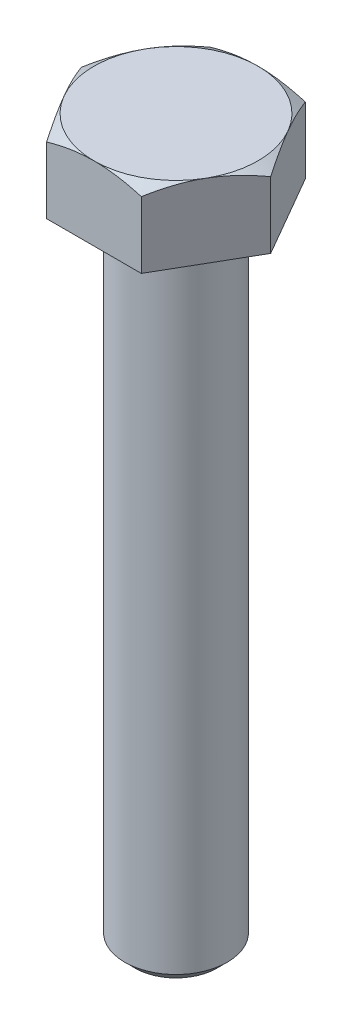
ISO-10303-21;
HEADER;
FILE_DESCRIPTION(('STEP AP214'),'2;1');
FILE_NAME('part.step','',(''),(''),'','','');
FILE_SCHEMA(('AUTOMOTIVE_DESIGN { 1 0 10303 214 1 1 1 1 }'));
ENDSEC;
DATA;
#1=APPLICATION_CONTEXT('core data for automotive mechanical design processes');
#2=APPLICATION_PROTOCOL_DEFINITION('international standard','automotive_design',2000,#1);
#3=PRODUCT_CONTEXT('',#1,'mechanical');
#4=PRODUCT('Part','Part','',(#3));
#5=PRODUCT_RELATED_PRODUCT_CATEGORY('part','',(#4));
#6=PRODUCT_DEFINITION_FORMATION('','',#4);
#7=PRODUCT_DEFINITION_CONTEXT('part definition',#1,'design');
#8=PRODUCT_DEFINITION('design','',#6,#7);
#9=PRODUCT_DEFINITION_SHAPE('','',#8);
#10=(LENGTH_UNIT() NAMED_UNIT(*) SI_UNIT(.MILLI.,.METRE.));
#11=(NAMED_UNIT(*) PLANE_ANGLE_UNIT() SI_UNIT($,.RADIAN.));
#12=(NAMED_UNIT(*) SI_UNIT($,.STERADIAN.) SOLID_ANGLE_UNIT());
#13=UNCERTAINTY_MEASURE_WITH_UNIT(LENGTH_MEASURE(1.E-05),#10,'distance_accuracy_value','');
#14=(GEOMETRIC_REPRESENTATION_CONTEXT(3) GLOBAL_UNCERTAINTY_ASSIGNED_CONTEXT((#13)) GLOBAL_UNIT_ASSIGNED_CONTEXT((#10,
#11,#12)) REPRESENTATION_CONTEXT('',''));
#15=CARTESIAN_POINT('',(0.,0.,0.));
#16=DIRECTION('',(0.,0.,1.));
#17=DIRECTION('',(1.,0.,0.));
#18=AXIS2_PLACEMENT_3D('',#15,#16,#17);
#19=CARTESIAN_POINT('',(-4.61880215351701,3.6,0.));
#20=DIRECTION('',(0.866025403784438,0.,-0.5));
#21=DIRECTION('',(-0.5,0.,-0.866025403784438));
#22=AXIS2_PLACEMENT_3D('',#19,#20,#21);
#23=PLANE('',#22);
#24=DIRECTION('',(0.,-1.,0.));
#25=VECTOR('',#24,1.);
#26=CARTESIAN_POINT('',(-2.3094010767585,3.6,4.));
#27=LINE('',#26,#25);
#28=CARTESIAN_POINT('',(-2.3094010767585,3.24273441009184,4.));
#29=VERTEX_POINT('',#28);
#30=CARTESIAN_POINT('',(-2.3094010767585,0.,4.));
#31=VERTEX_POINT('',#30);
#32=EDGE_CURVE('E131',#29,#31,#27,.T.);
#33=ORIENTED_EDGE('',*,*,#32,.F.);
#34=CARTESIAN_POINT('',(-2.30928560670467,3.24266774092524,4.0002));
#35=CARTESIAN_POINT('',(-2.4107717464617,3.30128212635172,3.82442084967677));
#36=CARTESIAN_POINT('',(-2.51313390883499,3.35458967853774,3.64712438367362));
#37=CARTESIAN_POINT('',(-2.71963072479812,3.4476383292536,3.28946140682429));
#38=CARTESIAN_POINT('',(-2.82376904741904,3.4873465109703,3.10908854102985));
#39=CARTESIAN_POINT('',(-3.03075510011795,3.54915778471972,2.75057818129721));
#40=CARTESIAN_POINT('',(-3.13357098372492,3.57167226847711,2.57249584706486));
#41=CARTESIAN_POINT('',(-3.33968651028528,3.59854937685342,2.21549328283349));
#42=CARTESIAN_POINT('',(-3.44298540411434,3.60293425857306,2.0365743503559));
#43=CARTESIAN_POINT('',(-3.63600352522932,3.59380992706003,1.70225715780327));
#44=CARTESIAN_POINT('',(-3.72575165335065,3.58254104601201,1.54680884001294));
#45=CARTESIAN_POINT('',(-3.90466320392054,3.54682600920181,1.23692494436495));
#46=CARTESIAN_POINT('',(-3.99382600759478,3.52236765428847,1.08249043825587));
#47=CARTESIAN_POINT('',(-4.17310641015197,3.46122393508071,0.771967672225424));
#48=CARTESIAN_POINT('',(-4.26320131938131,3.42427939634514,0.6159187119369));
#49=CARTESIAN_POINT('',(-4.4420474282755,3.34042992745198,0.306148164596163));
#50=CARTESIAN_POINT('',(-4.53080091904966,3.29354469778726,0.152422609226223));
#51=CARTESIAN_POINT('',(-4.61891762357085,3.24266774092524,-0.000199999999998293));
#52=B_SPLINE_CURVE_WITH_KNOTS('',3,(#34,#35,#36,#37,#38,#39,#40,#41,#42,#43,#44,#45,#46,#47,#48,
#49,#50,#51),.UNSPECIFIED.,.F.,.F.,(4,2,2,2,2,2,2,2,4),(0.,0.634047835695965,1.26961969224543,
1.88946157213122,2.50854226669297,3.04757825393385,3.58711366126903,4.13861653143763,
4.68903648037743),.UNSPECIFIED.);
#53=CARTESIAN_POINT('',(-3.46410161513776,3.6,2.));
#54=VERTEX_POINT('',#53);
#55=EDGE_CURVE('E113',#29,#54,#52,.T.);
#56=ORIENTED_EDGE('',*,*,#55,.T.);
#57=CARTESIAN_POINT('',(-4.61880215351701,3.24273441009184,0.));
#58=VERTEX_POINT('',#57);
#59=EDGE_CURVE('E50',#54,#58,#52,.T.);
#60=ORIENTED_EDGE('',*,*,#59,.T.);
#61=DIRECTION('',(0.,-1.,0.));
#62=VECTOR('',#61,1.);
#63=CARTESIAN_POINT('',(-4.61880215351701,3.6,0.));
#64=LINE('',#63,#62);
#65=CARTESIAN_POINT('',(-4.61880215351701,0.,0.));
#66=VERTEX_POINT('',#65);
#67=EDGE_CURVE('E219',#58,#66,#64,.T.);
#68=ORIENTED_EDGE('',*,*,#67,.T.);
#69=DIRECTION('',(0.5,0.,0.866025403784438));
#70=VECTOR('',#69,1.);
#71=CARTESIAN_POINT('',(-4.61880215351701,0.,0.));
#72=LINE('',#71,#70);
#73=EDGE_CURVE('E251',#66,#31,#72,.T.);
#74=ORIENTED_EDGE('',*,*,#73,.T.);
#75=EDGE_LOOP('',(#33,#56,#60,#68,#74));
#76=FACE_BOUND('',#75,.T.);
#77=ADVANCED_FACE('F35',(#76),#23,.F.);
#78=CARTESIAN_POINT('',(-2.3094010767585,3.6,4.));
#79=DIRECTION('',(0.,0.,-1.));
#80=DIRECTION('',(-1.,0.,0.));
#81=AXIS2_PLACEMENT_3D('',#78,#79,#80);
#82=PLANE('',#81);
#83=DIRECTION('',(0.,-1.,0.));
#84=VECTOR('',#83,1.);
#85=CARTESIAN_POINT('',(2.3094010767585,3.6,4.));
#86=LINE('',#85,#84);
#87=CARTESIAN_POINT('',(2.3094010767585,3.24273441009184,4.));
#88=VERTEX_POINT('',#87);
#89=CARTESIAN_POINT('',(2.3094010767585,0.,4.));
#90=VERTEX_POINT('',#89);
#91=EDGE_CURVE('E140',#88,#90,#86,.T.);
#92=ORIENTED_EDGE('',*,*,#91,.F.);
#93=CARTESIAN_POINT('',(-6.24940635930047,1.62551344036776,4.));
#94=CARTESIAN_POINT('',(-6.07428448900049,1.71064747987545,4.));
#95=CARTESIAN_POINT('',(-5.89876548029326,1.79497835243417,4.));
#96=CARTESIAN_POINT('',(-5.54672211906498,1.96158287333262,4.));
#97=CARTESIAN_POINT('',(-5.37019761736144,2.04385620609498,4.));
#98=CARTESIAN_POINT('',(-5.01504490338349,2.20629872772743,4.));
#99=CARTESIAN_POINT('',(-4.83641049751753,2.28645442132201,4.));
#100=CARTESIAN_POINT('',(-4.47773664602175,2.44354583504124,4.));
#101=CARTESIAN_POINT('',(-4.29769726596282,2.52048170438302,4.));
#102=CARTESIAN_POINT('',(-3.92999059977646,2.67274299461611,4.));
#103=CARTESIAN_POINT('',(-3.74226684291809,2.74793277274817,4.));
#104=CARTESIAN_POINT('',(-3.36464028006104,2.89273242177569,4.));
#105=CARTESIAN_POINT('',(-3.17473723480372,2.96234167316809,4.));
#106=CARTESIAN_POINT('',(-2.79279054903283,3.09418697758614,4.));
#107=CARTESIAN_POINT('',(-2.60075197178906,3.15643755350068,4.));
#108=CARTESIAN_POINT('',(-2.21392056037313,3.27159868104598,4.));
#109=CARTESIAN_POINT('',(-2.01912859936243,3.32451212497295,4.));
#110=CARTESIAN_POINT('',(-1.62774482428684,3.41821266061792,4.));
#111=CARTESIAN_POINT('',(-1.43116908477214,3.45906567182457,4.));
#112=CARTESIAN_POINT('',(-1.03552574288184,3.52636004480861,4.));
#113=CARTESIAN_POINT('',(-0.836458400413585,3.55280289715001,4.));
#114=CARTESIAN_POINT('',(-0.439446091637487,3.58882332594793,4.));
#115=CARTESIAN_POINT('',(-0.24152163810569,3.59862141132696,4.));
#116=CARTESIAN_POINT('',(0.154453996402157,3.60110504909964,4.));
#117=CARTESIAN_POINT('',(0.352505179929297,3.59379024543415,4.));
#118=CARTESIAN_POINT('',(0.687338202310109,3.56747918456206,4.));
#119=CARTESIAN_POINT('',(0.82447278485569,3.55270191181686,4.));
#120=CARTESIAN_POINT('',(1.09776247444183,3.51583749827029,4.));
#121=CARTESIAN_POINT('',(1.23391745151307,3.49374940513334,4.));
#122=CARTESIAN_POINT('',(1.64071426863145,3.41767735393902,4.));
#123=CARTESIAN_POINT('',(1.909546136988,3.35389827442858,4.));
#124=CARTESIAN_POINT('',(2.31167487066307,3.24297219927682,4.));
#125=CARTESIAN_POINT('',(2.44704596337128,3.2029139467991,4.));
#126=CARTESIAN_POINT('',(2.71647338785264,3.11855757903275,4.));
#127=CARTESIAN_POINT('',(2.8505297099327,3.07425943251157,4.));
#128=CARTESIAN_POINT('',(3.11736990171724,2.98214085736617,4.));
#129=CARTESIAN_POINT('',(3.25015414507458,2.93432150127419,4.));
#130=CARTESIAN_POINT('',(3.51461580134907,2.83573112785319,4.));
#131=CARTESIAN_POINT('',(3.64629323601141,2.7849601686694,4.));
#132=CARTESIAN_POINT('',(3.98974115401558,2.64882040183493,4.));
#133=CARTESIAN_POINT('',(4.20072121370987,2.56145980267336,4.));
#134=CARTESIAN_POINT('',(4.6206111085548,2.3818810585617,4.));
#135=CARTESIAN_POINT('',(4.82952074345979,2.28966244910213,4.));
#136=CARTESIAN_POINT('',(5.24571734836435,2.10147917973074,4.));
#137=CARTESIAN_POINT('',(5.45300380399208,2.00551338579897,4.));
#138=CARTESIAN_POINT('',(5.86621623056716,1.81069039404226,4.));
#139=CARTESIAN_POINT('',(6.07214216333142,1.71183311548681,4.));
#140=CARTESIAN_POINT('',(6.48317576116128,1.5116988626759,4.));
#141=CARTESIAN_POINT('',(6.68828184186467,1.41041864083382,4.));
#142=CARTESIAN_POINT('',(7.09758118816534,1.20602838870632,4.));
#143=CARTESIAN_POINT('',(7.30177444450839,1.1029183399225,4.));
#144=CARTESIAN_POINT('',(7.91315088994458,0.79142667249073,4.));
#145=CARTESIAN_POINT('',(8.31921202095451,0.580843592735333,4.));
#146=CARTESIAN_POINT('',(9.08866531435688,0.177008308553519,4.));
#147=CARTESIAN_POINT('',(9.45225649813083,-0.015866483077707,4.));
#148=CARTESIAN_POINT('',(10.1781923686025,-0.403993091815227,4.));
#149=CARTESIAN_POINT('',(10.5405369871479,-0.59924503631772,4.));
#150=CARTESIAN_POINT('',(11.2631431051462,-0.990910831585374,4.));
#151=CARTESIAN_POINT('',(11.6234075799627,-1.18731920155307,4.));
#152=CARTESIAN_POINT('',(12.3431558971906,-1.58150085066985,4.));
#153=CARTESIAN_POINT('',(12.7026397935455,-1.77927403128081,4.));
#154=CARTESIAN_POINT('',(13.0618463100356,-1.97754655898725,4.));
#155=B_SPLINE_CURVE_WITH_KNOTS('',3,(#93,#94,#95,#96,#97,#98,#99,#100,#101,#102,#103,#104,#105,
#106,#107,#108,#109,#110,#111,#112,#113,#114,#115,#116,#117,#118,#119,#120,#121,#122,#123,#124,
#125,#126,#127,#128,#129,#130,#131,#132,#133,#134,#135,#136,#137,#138,#139,#140,#141,#142,#143,
#144,#145,#146,#147,#148,#149,#150,#151,#152,#153,#154),.UNSPECIFIED.,.F.,.F.,(4,2,2,2,2,2,2,2,
2,2,2,2,2,2,2,2,2,2,2,2,2,2,2,2,2,2,2,2,2,2,4),(0.,0.584163807823883,1.16841666962886,
1.75577240153706,2.34310088325995,2.94969809380426,3.5563625506822,4.16180898136352,
4.76706753677513,5.36895389225969,5.97077797774916,6.56456509717167,7.15836457132933,
7.57195031441829,7.98558995399365,8.81329454925417,9.23677834024344,9.66026525100243,
10.0836237003962,10.5069738126466,11.191939723508,11.8769712482122,12.5622117174091,
13.2474713368833,13.9337075353919,14.6199506752735,15.9921653348798,17.2269004214626,
18.4617019737336,19.6926743313507,20.9235587247819),.UNSPECIFIED.);
#156=CARTESIAN_POINT('',(0.,3.6,4.));
#157=VERTEX_POINT('',#156);
#158=EDGE_CURVE('E117',#88,#157,#155,.F.);
#159=ORIENTED_EDGE('',*,*,#158,.T.);
#160=EDGE_CURVE('E106',#157,#29,#155,.F.);
#161=ORIENTED_EDGE('',*,*,#160,.T.);
#162=ORIENTED_EDGE('',*,*,#32,.T.);
#163=DIRECTION('',(1.,0.,0.));
#164=VECTOR('',#163,1.);
#165=CARTESIAN_POINT('',(-2.3094010767585,0.,4.));
#166=LINE('',#165,#164);
#167=EDGE_CURVE('E255',#31,#90,#166,.T.);
#168=ORIENTED_EDGE('',*,*,#167,.T.);
#169=EDGE_LOOP('',(#92,#159,#161,#162,#168));
#170=FACE_BOUND('',#169,.T.);
#171=ADVANCED_FACE('F138',(#170),#82,.F.);
#172=CARTESIAN_POINT('',(2.3094010767585,3.6,4.));
#173=DIRECTION('',(-0.866025403784439,0.,-0.5));
#174=DIRECTION('',(-0.5,0.,0.866025403784439));
#175=AXIS2_PLACEMENT_3D('',#172,#173,#174);
#176=PLANE('',#175);
#177=DIRECTION('',(0.,-1.,0.));
#178=VECTOR('',#177,1.);
#179=CARTESIAN_POINT('',(4.618802153517,3.6,0.));
#180=LINE('',#179,#178);
#181=CARTESIAN_POINT('',(4.618802153517,3.24273441009184,0.));
#182=VERTEX_POINT('',#181);
#183=CARTESIAN_POINT('',(4.618802153517,0.,0.));
#184=VERTEX_POINT('',#183);
#185=EDGE_CURVE('E215',#182,#184,#180,.T.);
#186=ORIENTED_EDGE('',*,*,#185,.F.);
#187=CARTESIAN_POINT('',(4.61891762357084,3.24266774092524,-0.000200000000001151));
#188=CARTESIAN_POINT('',(4.5174314838138,3.30128212635172,0.175579150323226));
#189=CARTESIAN_POINT('',(4.41506932144052,3.35458967853774,0.352875616326379));
#190=CARTESIAN_POINT('',(4.20857250547739,3.4476383292536,0.710538593175704));
#191=CARTESIAN_POINT('',(4.10443418285647,3.4873465109703,0.890911458970149));
#192=CARTESIAN_POINT('',(3.89744813015756,3.54915778471972,1.24942181870279));
#193=CARTESIAN_POINT('',(3.79463224655059,3.57167226847711,1.42750415293514));
#194=CARTESIAN_POINT('',(3.58851671999023,3.59854937685342,1.78450671716651));
#195=CARTESIAN_POINT('',(3.48521782616117,3.60293425857306,1.9634256496441));
#196=CARTESIAN_POINT('',(3.29219970504619,3.59380992706003,2.29774284219673));
#197=CARTESIAN_POINT('',(3.20245157692486,3.58254104601201,2.45319115998706));
#198=CARTESIAN_POINT('',(3.02354002635497,3.54682600920181,2.76307505563505));
#199=CARTESIAN_POINT('',(2.93437722268073,3.52236765428847,2.91750956174413));
#200=CARTESIAN_POINT('',(2.75509682012354,3.46122393508071,3.22803232777458));
#201=CARTESIAN_POINT('',(2.6650019108942,3.42427939634514,3.3840812880631));
#202=CARTESIAN_POINT('',(2.48615580200001,3.34042992745198,3.69385183540384));
#203=CARTESIAN_POINT('',(2.39740231122585,3.29354469778726,3.84757739077378));
#204=CARTESIAN_POINT('',(2.30928560670466,3.24266774092524,4.0002));
#205=B_SPLINE_CURVE_WITH_KNOTS('',3,(#187,#188,#189,#190,#191,#192,#193,#194,#195,#196,#197,
#198,#199,#200,#201,#202,#203,#204),.UNSPECIFIED.,.F.,.F.,(4,2,2,2,2,2,2,2,4),(0.,
0.634047835695964,1.26961969224543,1.88946157213122,2.50854226669297,3.04757825393385,
3.58711366126903,4.13861653143764,4.68903648037743),.UNSPECIFIED.);
#206=CARTESIAN_POINT('',(3.46410161513776,3.6,2.));
#207=VERTEX_POINT('',#206);
#208=EDGE_CURVE('E256',#182,#207,#205,.T.);
#209=ORIENTED_EDGE('',*,*,#208,.T.);
#210=EDGE_CURVE('E126',#207,#88,#205,.T.);
#211=ORIENTED_EDGE('',*,*,#210,.T.);
#212=ORIENTED_EDGE('',*,*,#91,.T.);
#213=DIRECTION('',(0.5,0.,-0.866025403784439));
#214=VECTOR('',#213,1.);
#215=CARTESIAN_POINT('',(2.3094010767585,0.,4.));
#216=LINE('',#215,#214);
#217=EDGE_CURVE('E257',#90,#184,#216,.T.);
#218=ORIENTED_EDGE('',*,*,#217,.T.);
#219=EDGE_LOOP('',(#186,#209,#211,#212,#218));
#220=FACE_BOUND('',#219,.T.);
#221=ADVANCED_FACE('F167',(#220),#176,.F.);
#222=CARTESIAN_POINT('',(4.618802153517,3.6,0.));
#223=DIRECTION('',(-0.866025403784438,0.,0.5));
#224=DIRECTION('',(0.5,0.,0.866025403784439));
#225=AXIS2_PLACEMENT_3D('',#222,#223,#224);
#226=PLANE('',#225);
#227=DIRECTION('',(0.,-1.,0.));
#228=VECTOR('',#227,1.);
#229=CARTESIAN_POINT('',(2.3094010767585,3.6,-4.));
#230=LINE('',#229,#228);
#231=CARTESIAN_POINT('',(2.3094010767585,3.24273441009184,-4.));
#232=VERTEX_POINT('',#231);
#233=CARTESIAN_POINT('',(2.3094010767585,0.,-4.));
#234=VERTEX_POINT('',#233);
#235=EDGE_CURVE('E209',#232,#234,#230,.T.);
#236=ORIENTED_EDGE('',*,*,#235,.F.);
#237=CARTESIAN_POINT('',(2.30928560670466,3.24266774092524,-4.0002));
#238=CARTESIAN_POINT('',(2.4107717464617,3.30128212635172,-3.82442084967677));
#239=CARTESIAN_POINT('',(2.51313390883499,3.35458967853774,-3.64712438367362));
#240=CARTESIAN_POINT('',(2.71963072479811,3.4476383292536,-3.2894614068243));
#241=CARTESIAN_POINT('',(2.82376904741904,3.4873465109703,-3.10908854102985));
#242=CARTESIAN_POINT('',(3.03075510011795,3.54915778471972,-2.75057818129721));
#243=CARTESIAN_POINT('',(3.13357098372491,3.57167226847711,-2.57249584706486));
#244=CARTESIAN_POINT('',(3.33968651028528,3.59854937685342,-2.21549328283349));
#245=CARTESIAN_POINT('',(3.44298540411434,3.60293425857306,-2.0365743503559));
#246=CARTESIAN_POINT('',(3.63600352522932,3.59380992706003,-1.70225715780327));
#247=CARTESIAN_POINT('',(3.72575165335064,3.58254104601201,-1.54680884001294));
#248=CARTESIAN_POINT('',(3.90466320392054,3.54682600920181,-1.23692494436495));
#249=CARTESIAN_POINT('',(3.99382600759478,3.52236765428847,-1.08249043825587));
#250=CARTESIAN_POINT('',(4.17310641015197,3.46122393508072,-0.771967672225425));
#251=CARTESIAN_POINT('',(4.26320131938131,3.42427939634514,-0.6159187119369));
#252=CARTESIAN_POINT('',(4.4420474282755,3.34042992745198,-0.306148164596163));
#253=CARTESIAN_POINT('',(4.53080091904966,3.29354469778727,-0.152422609226223));
#254=CARTESIAN_POINT('',(4.61891762357084,3.24266774092524,0.000199999999998474));
#255=B_SPLINE_CURVE_WITH_KNOTS('',3,(#237,#238,#239,#240,#241,#242,#243,#244,#245,#246,#247,
#248,#249,#250,#251,#252,#253,#254),.UNSPECIFIED.,.F.,.F.,(4,2,2,2,2,2,2,2,4),(0.,
0.634047835695965,1.26961969224543,1.88946157213122,2.50854226669297,3.04757825393385,
3.58711366126903,4.13861653143764,4.68903648037743),.UNSPECIFIED.);
#256=CARTESIAN_POINT('',(3.46410161513776,3.6,-2.));
#257=VERTEX_POINT('',#256);
#258=EDGE_CURVE('E118',#232,#257,#255,.T.);
#259=ORIENTED_EDGE('',*,*,#258,.T.);
#260=EDGE_CURVE('E141',#257,#182,#255,.T.);
#261=ORIENTED_EDGE('',*,*,#260,.T.);
#262=ORIENTED_EDGE('',*,*,#185,.T.);
#263=DIRECTION('',(-0.5,0.,-0.866025403784438));
#264=VECTOR('',#263,1.);
#265=CARTESIAN_POINT('',(4.618802153517,0.,0.));
#266=LINE('',#265,#264);
#267=EDGE_CURVE('E211',#184,#234,#266,.T.);
#268=ORIENTED_EDGE('',*,*,#267,.T.);
#269=EDGE_LOOP('',(#236,#259,#261,#262,#268));
#270=FACE_BOUND('',#269,.T.);
#271=ADVANCED_FACE('F195',(#270),#226,.F.);
#272=CARTESIAN_POINT('',(2.3094010767585,3.6,-4.));
#273=DIRECTION('',(0.,0.,1.));
#274=DIRECTION('',(1.,0.,0.));
#275=AXIS2_PLACEMENT_3D('',#272,#273,#274);
#276=PLANE('',#275);
#277=DIRECTION('',(0.,-1.,0.));
#278=VECTOR('',#277,1.);
#279=CARTESIAN_POINT('',(-2.3094010767585,3.6,-4.));
#280=LINE('',#279,#278);
#281=CARTESIAN_POINT('',(-2.3094010767585,3.24273441009184,-4.));
#282=VERTEX_POINT('',#281);
#283=CARTESIAN_POINT('',(-2.3094010767585,0.,-4.));
#284=VERTEX_POINT('',#283);
#285=EDGE_CURVE('E216',#282,#284,#280,.T.);
#286=ORIENTED_EDGE('',*,*,#285,.F.);
#287=CARTESIAN_POINT('',(-6.24940635930047,1.62551344036776,-4.));
#288=CARTESIAN_POINT('',(-6.0742844890005,1.71064747987545,-4.));
#289=CARTESIAN_POINT('',(-5.89876548029326,1.79497835243417,-4.));
#290=CARTESIAN_POINT('',(-5.54672211906498,1.96158287333261,-4.));
#291=CARTESIAN_POINT('',(-5.37019761736144,2.04385620609497,-4.));
#292=CARTESIAN_POINT('',(-5.01504490338349,2.20629872772743,-4.));
#293=CARTESIAN_POINT('',(-4.83641049751753,2.28645442132201,-4.));
#294=CARTESIAN_POINT('',(-4.47773664602175,2.44354583504124,-4.));
#295=CARTESIAN_POINT('',(-4.29769726596282,2.52048170438302,-4.));
#296=CARTESIAN_POINT('',(-3.92999059977646,2.67274299461611,-4.));
#297=CARTESIAN_POINT('',(-3.74226684291809,2.74793277274817,-4.));
#298=CARTESIAN_POINT('',(-3.36464028006104,2.89273242177569,-4.));
#299=CARTESIAN_POINT('',(-3.17473723480372,2.96234167316809,-4.));
#300=CARTESIAN_POINT('',(-2.79279054903283,3.09418697758614,-4.));
#301=CARTESIAN_POINT('',(-2.60075197178906,3.15643755350068,-4.));
#302=CARTESIAN_POINT('',(-2.21392056037313,3.27159868104598,-4.));
#303=CARTESIAN_POINT('',(-2.01912859936242,3.32451212497295,-4.));
#304=CARTESIAN_POINT('',(-1.62774482428684,3.41821266061792,-4.));
#305=CARTESIAN_POINT('',(-1.43116908477214,3.45906567182457,-4.));
#306=CARTESIAN_POINT('',(-1.03552574288184,3.52636004480861,-4.));
#307=CARTESIAN_POINT('',(-0.836458400413584,3.55280289715001,-4.));
#308=CARTESIAN_POINT('',(-0.439446091637487,3.58882332594793,-4.));
#309=CARTESIAN_POINT('',(-0.24152163810569,3.59862141132696,-4.));
#310=CARTESIAN_POINT('',(0.154453996402157,3.60110504909964,-4.));
#311=CARTESIAN_POINT('',(0.352505179929298,3.59379024543415,-4.));
#312=CARTESIAN_POINT('',(0.687338202310109,3.56747918456206,-4.));
#313=CARTESIAN_POINT('',(0.82447278485569,3.55270191181686,-4.));
#314=CARTESIAN_POINT('',(1.09776247444183,3.51583749827029,-4.));
#315=CARTESIAN_POINT('',(1.23391745151307,3.49374940513334,-4.));
#316=CARTESIAN_POINT('',(1.64071426863145,3.41767735393902,-4.));
#317=CARTESIAN_POINT('',(1.909546136988,3.35389827442858,-4.));
#318=CARTESIAN_POINT('',(2.31167487066307,3.24297219927682,-4.));
#319=CARTESIAN_POINT('',(2.44704596337128,3.2029139467991,-4.));
#320=CARTESIAN_POINT('',(2.71647338785264,3.11855757903275,-4.));
#321=CARTESIAN_POINT('',(2.8505297099327,3.07425943251157,-4.));
#322=CARTESIAN_POINT('',(3.11736990171724,2.98214085736617,-4.));
#323=CARTESIAN_POINT('',(3.25015414507458,2.93432150127419,-4.));
#324=CARTESIAN_POINT('',(3.51461580134908,2.83573112785319,-4.));
#325=CARTESIAN_POINT('',(3.64629323601141,2.78496016866939,-4.));
#326=CARTESIAN_POINT('',(3.98974115401559,2.64882040183492,-4.));
#327=CARTESIAN_POINT('',(4.20072121370987,2.56145980267335,-4.));
#328=CARTESIAN_POINT('',(4.6206111085548,2.3818810585617,-4.));
#329=CARTESIAN_POINT('',(4.82952074345979,2.28966244910213,-4.));
#330=CARTESIAN_POINT('',(5.24571734836436,2.10147917973074,-4.));
#331=CARTESIAN_POINT('',(5.45300380399208,2.00551338579896,-4.));
#332=CARTESIAN_POINT('',(5.86621623056716,1.81069039404226,-4.));
#333=CARTESIAN_POINT('',(6.07214216333142,1.71183311548681,-4.));
#334=CARTESIAN_POINT('',(6.48317576116129,1.51169886267589,-4.));
#335=CARTESIAN_POINT('',(6.68828184186467,1.41041864083382,-4.));
#336=CARTESIAN_POINT('',(7.09758118816534,1.20602838870632,-4.));
#337=CARTESIAN_POINT('',(7.30177444450839,1.1029183399225,-4.));
#338=CARTESIAN_POINT('',(7.91315088994458,0.791426672490727,-4.));
#339=CARTESIAN_POINT('',(8.31921202095452,0.58084359273533,-4.));
#340=CARTESIAN_POINT('',(9.08866531435689,0.177008308553517,-4.));
#341=CARTESIAN_POINT('',(9.45225649813083,-0.0158664830777106,-4.));
#342=CARTESIAN_POINT('',(10.1781923686026,-0.40399309181523,-4.));
#343=CARTESIAN_POINT('',(10.5405369871479,-0.599245036317723,-4.));
#344=CARTESIAN_POINT('',(11.2631431051462,-0.990910831585375,-4.));
#345=CARTESIAN_POINT('',(11.6234075799627,-1.18731920155307,-4.));
#346=CARTESIAN_POINT('',(12.3431558971906,-1.58150085066985,-4.));
#347=CARTESIAN_POINT('',(12.7026397935455,-1.77927403128081,-4.));
#348=CARTESIAN_POINT('',(13.0618463100356,-1.97754655898725,-4.));
#349=B_SPLINE_CURVE_WITH_KNOTS('',3,(#287,#288,#289,#290,#291,#292,#293,#294,#295,#296,#297,
#298,#299,#300,#301,#302,#303,#304,#305,#306,#307,#308,#309,#310,#311,#312,#313,#314,#315,#316,
#317,#318,#319,#320,#321,#322,#323,#324,#325,#326,#327,#328,#329,#330,#331,#332,#333,#334,#335,
#336,#337,#338,#339,#340,#341,#342,#343,#344,#345,#346,#347,#348),.UNSPECIFIED.,.F.,.F.,(4,2,2,
2,2,2,2,2,2,2,2,2,2,2,2,2,2,2,2,2,2,2,2,2,2,2,2,2,2,2,4),(0.,0.584163807823882,1.16841666962886,
1.75577240153706,2.34310088325995,2.94969809380426,3.5563625506822,4.16180898136352,
4.76706753677513,5.36895389225969,5.97077797774916,6.56456509717168,7.15836457132933,
7.57195031441829,7.98558995399365,8.81329454925417,9.23677834024344,9.66026525100243,
10.0836237003962,10.5069738126466,11.191939723508,11.8769712482122,12.5622117174091,
13.2474713368833,13.9337075353919,14.6199506752735,15.9921653348798,17.2269004214626,
18.4617019737336,19.6926743313507,20.9235587247819),.UNSPECIFIED.);
#350=CARTESIAN_POINT('',(0.,3.6,-4.));
#351=VERTEX_POINT('',#350);
#352=EDGE_CURVE('E177',#282,#351,#349,.T.);
#353=ORIENTED_EDGE('',*,*,#352,.T.);
#354=EDGE_CURVE('E185',#351,#232,#349,.T.);
#355=ORIENTED_EDGE('',*,*,#354,.T.);
#356=ORIENTED_EDGE('',*,*,#235,.T.);
#357=DIRECTION('',(-1.,0.,0.));
#358=VECTOR('',#357,1.);
#359=CARTESIAN_POINT('',(2.3094010767585,0.,-4.));
#360=LINE('',#359,#358);
#361=EDGE_CURVE('E263',#234,#284,#360,.T.);
#362=ORIENTED_EDGE('',*,*,#361,.T.);
#363=EDGE_LOOP('',(#286,#353,#355,#356,#362));
#364=FACE_BOUND('',#363,.T.);
#365=ADVANCED_FACE('F191',(#364),#276,.F.);
#366=CARTESIAN_POINT('',(-2.3094010767585,3.6,-4.));
#367=DIRECTION('',(0.866025403784439,0.,0.5));
#368=DIRECTION('',(0.5,0.,-0.866025403784439));
#369=AXIS2_PLACEMENT_3D('',#366,#367,#368);
#370=PLANE('',#369);
#371=ORIENTED_EDGE('',*,*,#67,.F.);
#372=CARTESIAN_POINT('',(-4.61891762357085,3.24266774092524,0.000200000000001726));
#373=CARTESIAN_POINT('',(-4.51743148381381,3.30128212635172,-0.175579150323226));
#374=CARTESIAN_POINT('',(-4.41506932144052,3.35458967853774,-0.352875616326378));
#375=CARTESIAN_POINT('',(-4.2085725054774,3.4476383292536,-0.710538593175704));
#376=CARTESIAN_POINT('',(-4.10443418285647,3.4873465109703,-0.890911458970148));
#377=CARTESIAN_POINT('',(-3.89744813015756,3.54915778471972,-1.24942181870279));
#378=CARTESIAN_POINT('',(-3.7946322465506,3.57167226847711,-1.42750415293514));
#379=CARTESIAN_POINT('',(-3.58851671999023,3.59854937685342,-1.78450671716651));
#380=CARTESIAN_POINT('',(-3.48521782616117,3.60293425857306,-1.9634256496441));
#381=CARTESIAN_POINT('',(-3.29219970504619,3.59380992706003,-2.29774284219673));
#382=CARTESIAN_POINT('',(-3.20245157692487,3.58254104601201,-2.45319115998706));
#383=CARTESIAN_POINT('',(-3.02354002635497,3.54682600920181,-2.76307505563505));
#384=CARTESIAN_POINT('',(-2.93437722268073,3.52236765428847,-2.91750956174413));
#385=CARTESIAN_POINT('',(-2.75509682012354,3.46122393508071,-3.22803232777458));
#386=CARTESIAN_POINT('',(-2.6650019108942,3.42427939634514,-3.3840812880631));
#387=CARTESIAN_POINT('',(-2.48615580200001,3.34042992745198,-3.69385183540384));
#388=CARTESIAN_POINT('',(-2.39740231122585,3.29354469778726,-3.84757739077378));
#389=CARTESIAN_POINT('',(-2.30928560670467,3.24266774092524,-4.0002));
#390=B_SPLINE_CURVE_WITH_KNOTS('',3,(#372,#373,#374,#375,#376,#377,#378,#379,#380,#381,#382,
#383,#384,#385,#386,#387,#388,#389),.UNSPECIFIED.,.F.,.F.,(4,2,2,2,2,2,2,2,4),(0.,
0.634047835695965,1.26961969224543,1.88946157213122,2.50854226669297,3.04757825393386,
3.58711366126903,4.13861653143764,4.68903648037743),.UNSPECIFIED.);
#391=CARTESIAN_POINT('',(-3.46410161513776,3.6,-2.));
#392=VERTEX_POINT('',#391);
#393=EDGE_CURVE('E184',#58,#392,#390,.T.);
#394=ORIENTED_EDGE('',*,*,#393,.T.);
#395=EDGE_CURVE('E58',#392,#282,#390,.T.);
#396=ORIENTED_EDGE('',*,*,#395,.T.);
#397=ORIENTED_EDGE('',*,*,#285,.T.);
#398=DIRECTION('',(-0.5,0.,0.866025403784439));
#399=VECTOR('',#398,1.);
#400=CARTESIAN_POINT('',(-2.3094010767585,0.,-4.));
#401=LINE('',#400,#399);
#402=EDGE_CURVE('E253',#284,#66,#401,.T.);
#403=ORIENTED_EDGE('',*,*,#402,.T.);
#404=EDGE_LOOP('',(#371,#394,#396,#397,#403));
#405=FACE_BOUND('',#404,.T.);
#406=ADVANCED_FACE('F194',(#405),#370,.F.);
#407=CARTESIAN_POINT('',(0.,0.,0.));
#408=DIRECTION('',(0.,1.,0.));
#409=DIRECTION('',(0.,0.,1.));
#410=AXIS2_PLACEMENT_3D('',#407,#408,#409);
#411=PLANE('',#410);
#412=CARTESIAN_POINT('',(0.,0.,0.));
#413=DIRECTION('',(0.,1.,0.));
#414=DIRECTION('',(0.,0.,1.));
#415=AXIS2_PLACEMENT_3D('',#412,#413,#414);
#416=CIRCLE('',#415,2.9);
#417=CARTESIAN_POINT('',(0.,0.,2.9));
#418=VERTEX_POINT('',#417);
#419=EDGE_CURVE('E11',#418,#418,#416,.T.);
#420=ORIENTED_EDGE('',*,*,#419,.T.);
#421=EDGE_LOOP('',(#420));
#422=FACE_BOUND('',#421,.T.);
#423=ORIENTED_EDGE('',*,*,#73,.F.);
#424=ORIENTED_EDGE('',*,*,#402,.F.);
#425=ORIENTED_EDGE('',*,*,#361,.F.);
#426=ORIENTED_EDGE('',*,*,#267,.F.);
#427=ORIENTED_EDGE('',*,*,#217,.F.);
#428=ORIENTED_EDGE('',*,*,#167,.F.);
#429=EDGE_LOOP('',(#423,#424,#425,#426,#427,#428));
#430=FACE_BOUND('',#429,.T.);
#431=ADVANCED_FACE('F244',(#422,#430),#411,.F.);
#432=CARTESIAN_POINT('',(0.,3.6,0.));
#433=DIRECTION('',(0.,-1.,0.));
#434=DIRECTION('',(0.,0.,-1.));
#435=AXIS2_PLACEMENT_3D('',#432,#433,#434);
#436=CONICAL_SURFACE('',#435,4.,1.0471975511966);
#437=CARTESIAN_POINT('',(0.,3.6,0.));
#438=DIRECTION('',(0.,1.,0.));
#439=DIRECTION('',(0.,0.,1.));
#440=AXIS2_PLACEMENT_3D('',#437,#438,#439);
#441=CIRCLE('',#440,4.);
#442=EDGE_CURVE('E123',#207,#157,#441,.F.);
#443=ORIENTED_EDGE('',*,*,#442,.T.);
#444=ORIENTED_EDGE('',*,*,#158,.F.);
#445=ORIENTED_EDGE('',*,*,#210,.F.);
#446=EDGE_LOOP('',(#443,#444,#445));
#447=FACE_BOUND('',#446,.T.);
#448=ADVANCED_FACE('F124',(#447),#436,.T.);
#449=ORIENTED_EDGE('',*,*,#260,.F.);
#450=EDGE_CURVE('E130',#257,#207,#441,.F.);
#451=ORIENTED_EDGE('',*,*,#450,.T.);
#452=ORIENTED_EDGE('',*,*,#208,.F.);
#453=EDGE_LOOP('',(#449,#451,#452));
#454=FACE_BOUND('',#453,.T.);
#455=ADVANCED_FACE('F160',(#454),#436,.T.);
#456=ORIENTED_EDGE('',*,*,#354,.F.);
#457=CARTESIAN_POINT('',(0.,3.6,0.));
#458=DIRECTION('',(0.,-1.,0.));
#459=DIRECTION('',(0.,0.,-1.));
#460=AXIS2_PLACEMENT_3D('',#457,#458,#459);
#461=CIRCLE('',#460,4.);
#462=EDGE_CURVE('E274',#351,#257,#461,.T.);
#463=ORIENTED_EDGE('',*,*,#462,.T.);
#464=ORIENTED_EDGE('',*,*,#258,.F.);
#465=EDGE_LOOP('',(#456,#463,#464));
#466=FACE_BOUND('',#465,.T.);
#467=ADVANCED_FACE('F272',(#466),#436,.T.);
#468=ORIENTED_EDGE('',*,*,#395,.F.);
#469=EDGE_CURVE('E275',#392,#351,#441,.F.);
#470=ORIENTED_EDGE('',*,*,#469,.T.);
#471=ORIENTED_EDGE('',*,*,#352,.F.);
#472=EDGE_LOOP('',(#468,#470,#471));
#473=FACE_BOUND('',#472,.T.);
#474=ADVANCED_FACE('F276',(#473),#436,.T.);
#475=EDGE_CURVE('E135',#54,#392,#441,.F.);
#476=ORIENTED_EDGE('',*,*,#475,.T.);
#477=ORIENTED_EDGE('',*,*,#393,.F.);
#478=ORIENTED_EDGE('',*,*,#59,.F.);
#479=EDGE_LOOP('',(#476,#477,#478));
#480=FACE_BOUND('',#479,.T.);
#481=ADVANCED_FACE('F277',(#480),#436,.T.);
#482=EDGE_CURVE('E110',#157,#54,#441,.F.);
#483=ORIENTED_EDGE('',*,*,#482,.T.);
#484=ORIENTED_EDGE('',*,*,#55,.F.);
#485=ORIENTED_EDGE('',*,*,#160,.F.);
#486=EDGE_LOOP('',(#483,#484,#485));
#487=FACE_BOUND('',#486,.T.);
#488=ADVANCED_FACE('F108',(#487),#436,.T.);
#489=CARTESIAN_POINT('',(0.,3.6,0.));
#490=DIRECTION('',(0.,1.,0.));
#491=DIRECTION('',(0.,0.,1.));
#492=AXIS2_PLACEMENT_3D('',#489,#490,#491);
#493=PLANE('',#492);
#494=ORIENTED_EDGE('',*,*,#482,.F.);
#495=ORIENTED_EDGE('',*,*,#442,.F.);
#496=ORIENTED_EDGE('',*,*,#450,.F.);
#497=ORIENTED_EDGE('',*,*,#462,.F.);
#498=ORIENTED_EDGE('',*,*,#469,.F.);
#499=ORIENTED_EDGE('',*,*,#475,.F.);
#500=EDGE_LOOP('',(#494,#495,#496,#497,#498,#499));
#501=FACE_BOUND('',#500,.T.);
#502=ADVANCED_FACE('F133',(#501),#493,.T.);
#503=CARTESIAN_POINT('',(0.,-31.5,0.));
#504=DIRECTION('',(0.,1.,0.));
#505=DIRECTION('',(0.,0.,1.));
#506=AXIS2_PLACEMENT_3D('',#503,#504,#505);
#507=CYLINDRICAL_SURFACE('',#506,2.5);
#508=CARTESIAN_POINT('',(0.,-0.400000000000001,0.));
#509=DIRECTION('',(0.,1.,0.));
#510=DIRECTION('',(0.,0.,1.));
#511=AXIS2_PLACEMENT_3D('',#508,#509,#510);
#512=CIRCLE('',#511,2.5);
#513=CARTESIAN_POINT('',(0.,-0.400000000000001,2.5));
#514=VERTEX_POINT('',#513);
#515=EDGE_CURVE('E43',#514,#514,#512,.F.);
#516=ORIENTED_EDGE('',*,*,#515,.T.);
#517=EDGE_LOOP('',(#516));
#518=FACE_BOUND('',#517,.T.);
#519=CARTESIAN_POINT('',(0.,-31.,0.));
#520=DIRECTION('',(0.,-1.,0.));
#521=DIRECTION('',(0.,0.,-1.));
#522=AXIS2_PLACEMENT_3D('',#519,#520,#521);
#523=CIRCLE('',#522,2.5);
#524=CARTESIAN_POINT('',(0.,-31.,-2.5));
#525=VERTEX_POINT('',#524);
#526=EDGE_CURVE('E227',#525,#525,#523,.F.);
#527=ORIENTED_EDGE('',*,*,#526,.T.);
#528=EDGE_LOOP('',(#527));
#529=FACE_BOUND('',#528,.T.);
#530=ADVANCED_FACE('F232',(#518,#529),#507,.T.);
#531=CARTESIAN_POINT('',(0.,-31.5,0.));
#532=DIRECTION('',(0.,-1.,0.));
#533=DIRECTION('',(0.,0.,-1.));
#534=AXIS2_PLACEMENT_3D('',#531,#532,#533);
#535=PLANE('',#534);
#536=CARTESIAN_POINT('',(0.,-31.5,0.));
#537=DIRECTION('',(0.,-1.,0.));
#538=DIRECTION('',(0.,0.,-1.));
#539=AXIS2_PLACEMENT_3D('',#536,#537,#538);
#540=CIRCLE('',#539,1.99999999999999);
#541=CARTESIAN_POINT('',(0.,-31.5,-1.99999999999999));
#542=VERTEX_POINT('',#541);
#543=EDGE_CURVE('E136',#542,#542,#540,.T.);
#544=ORIENTED_EDGE('',*,*,#543,.T.);
#545=EDGE_LOOP('',(#544));
#546=FACE_BOUND('',#545,.T.);
#547=ADVANCED_FACE('F240',(#546),#535,.T.);
#548=CARTESIAN_POINT('',(0.,-31.5,0.));
#549=DIRECTION('',(0.,1.,0.));
#550=DIRECTION('',(0.,0.,1.));
#551=AXIS2_PLACEMENT_3D('',#548,#549,#550);
#552=CONICAL_SURFACE('',#551,1.99999999999999,0.785398163397446);
#553=ORIENTED_EDGE('',*,*,#526,.F.);
#554=EDGE_LOOP('',(#553));
#555=FACE_BOUND('',#554,.T.);
#556=ORIENTED_EDGE('',*,*,#543,.F.);
#557=EDGE_LOOP('',(#556));
#558=FACE_BOUND('',#557,.T.);
#559=ADVANCED_FACE('F172',(#555,#558),#552,.T.);
#560=CARTESIAN_POINT('',(0.,-0.400000000000001,0.));
#561=DIRECTION('',(0.,1.,0.));
#562=DIRECTION('',(0.,0.,1.));
#563=AXIS2_PLACEMENT_3D('',#560,#561,#562);
#564=TOROIDAL_SURFACE('',#563,2.9,0.4);
#565=ORIENTED_EDGE('',*,*,#419,.F.);
#566=EDGE_LOOP('',(#565));
#567=FACE_BOUND('',#566,.T.);
#568=ORIENTED_EDGE('',*,*,#515,.F.);
#569=EDGE_LOOP('',(#568));
#570=FACE_BOUND('',#569,.T.);
#571=ADVANCED_FACE('F37',(#567,#570),#564,.F.);
#572=CLOSED_SHELL('',(#77,#171,#221,#271,#365,#406,#431,#448,#455,#467,#474,#481,#488,#502,#530,
#547,#559,#571));
#573=MANIFOLD_SOLID_BREP('B2',#572);
#574=ADVANCED_BREP_SHAPE_REPRESENTATION('',(#18,#573),#14);
#575=SHAPE_DEFINITION_REPRESENTATION(#9,#574);
ENDSEC;
END-ISO-10303-21;
